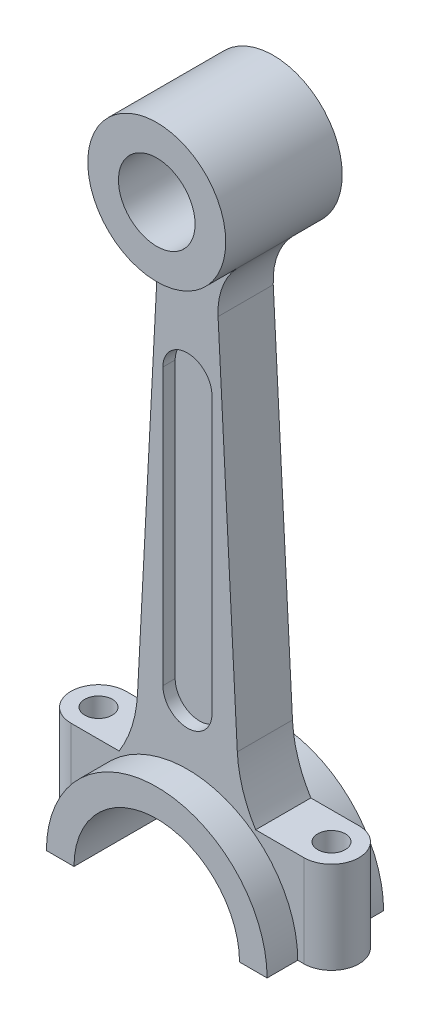
ISO-10303-21;
HEADER;
FILE_DESCRIPTION(('STEP AP214'),'2;1');
FILE_NAME('part.step','',(''),(''),'','','');
FILE_SCHEMA(('AUTOMOTIVE_DESIGN { 1 0 10303 214 1 1 1 1 }'));
ENDSEC;
DATA;
#1=APPLICATION_CONTEXT('core data for automotive mechanical design processes');
#2=APPLICATION_PROTOCOL_DEFINITION('international standard','automotive_design',2000,#1);
#3=PRODUCT_CONTEXT('',#1,'mechanical');
#4=PRODUCT('Part','Part','',(#3));
#5=PRODUCT_RELATED_PRODUCT_CATEGORY('part','',(#4));
#6=PRODUCT_DEFINITION_FORMATION('','',#4);
#7=PRODUCT_DEFINITION_CONTEXT('part definition',#1,'design');
#8=PRODUCT_DEFINITION('design','',#6,#7);
#9=PRODUCT_DEFINITION_SHAPE('','',#8);
#10=(LENGTH_UNIT() NAMED_UNIT(*) SI_UNIT(.MILLI.,.METRE.));
#11=(NAMED_UNIT(*) PLANE_ANGLE_UNIT() SI_UNIT($,.RADIAN.));
#12=(NAMED_UNIT(*) SI_UNIT($,.STERADIAN.) SOLID_ANGLE_UNIT());
#13=UNCERTAINTY_MEASURE_WITH_UNIT(LENGTH_MEASURE(1.E-05),#10,'distance_accuracy_value','');
#14=(GEOMETRIC_REPRESENTATION_CONTEXT(3) GLOBAL_UNCERTAINTY_ASSIGNED_CONTEXT((#13)) GLOBAL_UNIT_ASSIGNED_CONTEXT((#10,
#11,#12)) REPRESENTATION_CONTEXT('',''));
#15=CARTESIAN_POINT('',(0.,0.,0.));
#16=DIRECTION('',(0.,0.,1.));
#17=DIRECTION('',(1.,0.,0.));
#18=AXIS2_PLACEMENT_3D('',#15,#16,#17);
#19=CARTESIAN_POINT('',(0.,0.,8.9999999999999));
#20=DIRECTION('',(0.,0.,1.));
#21=DIRECTION('',(1.,0.,0.));
#22=AXIS2_PLACEMENT_3D('',#19,#20,#21);
#23=PLANE('',#22);
#24=CARTESIAN_POINT('',(0.,-145.6,8.9999999999999));
#25=DIRECTION('',(0.,0.,1.));
#26=DIRECTION('',(1.,0.,0.));
#27=AXIS2_PLACEMENT_3D('',#24,#25,#26);
#28=CIRCLE('',#27,8.00000000000002);
#29=CARTESIAN_POINT('',(-8.00000000000002,-145.6,8.9999999999999));
#30=VERTEX_POINT('',#29);
#31=CARTESIAN_POINT('',(8.00000000000004,-145.6,8.9999999999999));
#32=VERTEX_POINT('',#31);
#33=EDGE_CURVE('E305',#30,#32,#28,.T.);
#34=ORIENTED_EDGE('',*,*,#33,.F.);
#35=DIRECTION('',(0.,-1.,0.));
#36=VECTOR('',#35,1.);
#37=CARTESIAN_POINT('',(-8.00000000000002,-145.6,8.9999999999999));
#38=LINE('',#37,#36);
#39=CARTESIAN_POINT('',(-8.00000000000003,-55.6,8.9999999999999));
#40=VERTEX_POINT('',#39);
#41=EDGE_CURVE('E320',#40,#30,#38,.T.);
#42=ORIENTED_EDGE('',*,*,#41,.F.);
#43=CARTESIAN_POINT('',(0.,-55.6,8.9999999999999));
#44=DIRECTION('',(0.,0.,1.));
#45=DIRECTION('',(1.,0.,0.));
#46=AXIS2_PLACEMENT_3D('',#43,#44,#45);
#47=CIRCLE('',#46,8.00000000000002);
#48=CARTESIAN_POINT('',(8.00000000000001,-55.6,8.9999999999999));
#49=VERTEX_POINT('',#48);
#50=EDGE_CURVE('E339',#49,#40,#47,.T.);
#51=ORIENTED_EDGE('',*,*,#50,.F.);
#52=DIRECTION('',(0.,1.,0.));
#53=VECTOR('',#52,1.);
#54=CARTESIAN_POINT('',(8.00000000000004,-145.6,8.9999999999999));
#55=LINE('',#54,#53);
#56=EDGE_CURVE('E335',#32,#49,#55,.T.);
#57=ORIENTED_EDGE('',*,*,#56,.F.);
#58=EDGE_LOOP('',(#34,#42,#51,#57));
#59=FACE_BOUND('',#58,.T.);
#60=DIRECTION('',(1.,0.,0.));
#61=VECTOR('',#60,1.);
#62=CARTESIAN_POINT('',(47.,-201.2,8.9999999999999));
#63=LINE('',#62,#61);
#64=CARTESIAN_POINT('',(36.,-201.2,8.9999999999999));
#65=VERTEX_POINT('',#64);
#66=CARTESIAN_POINT('',(38.,-201.2,8.9999999999999));
#67=VERTEX_POINT('',#66);
#68=EDGE_CURVE('E230',#65,#67,#63,.T.);
#69=ORIENTED_EDGE('',*,*,#68,.T.);
#70=DIRECTION('',(0.,-1.,0.));
#71=VECTOR('',#70,1.);
#72=CARTESIAN_POINT('',(38.,22.5,8.9999999999999));
#73=LINE('',#72,#71);
#74=CARTESIAN_POINT('',(38.,-171.2,8.9999999999999));
#75=VERTEX_POINT('',#74);
#76=EDGE_CURVE('E236',#75,#67,#73,.T.);
#77=ORIENTED_EDGE('',*,*,#76,.F.);
#78=DIRECTION('',(-1.,0.,0.));
#79=VECTOR('',#78,1.);
#80=CARTESIAN_POINT('',(-47.,-171.2,8.9999999999999));
#81=LINE('',#80,#79);
#82=CARTESIAN_POINT('',(22.264288887721,-171.2,8.9999999999999));
#83=VERTEX_POINT('',#82);
#84=EDGE_CURVE('E248',#75,#83,#81,.T.);
#85=ORIENTED_EDGE('',*,*,#84,.T.);
#86=CARTESIAN_POINT('',(56.2249036129652,-150.065273896179,8.9999999999999));
#87=DIRECTION('',(0.,0.,-1.));
#88=DIRECTION('',(-1.,0.,0.));
#89=AXIS2_PLACEMENT_3D('',#86,#87,#88);
#90=CIRCLE('',#89,40.);
#91=CARTESIAN_POINT('',(16.2797222227823,-152.158712145897,8.9999999999999));
#92=VERTEX_POINT('',#91);
#93=EDGE_CURVE('E403',#83,#92,#90,.T.);
#94=ORIENTED_EDGE('',*,*,#93,.T.);
#95=DIRECTION('',(-0.0523359562429447,0.998629534754574,0.));
#96=VECTOR('',#95,1.);
#97=CARTESIAN_POINT('',(16.2797222227823,-152.158712145897,8.9999999999999));
#98=LINE('',#97,#96);
#99=CARTESIAN_POINT('',(10.,-32.3344740520251,8.9999999999999));
#100=VERTEX_POINT('',#99);
#101=EDGE_CURVE('E406',#92,#100,#98,.T.);
#102=ORIENTED_EDGE('',*,*,#101,.T.);
#103=CARTESIAN_POINT('',(32.4691645319779,-31.1569150365588,8.9999999999999));
#104=DIRECTION('',(0.,0.,-1.));
#105=DIRECTION('',(1.,0.,0.));
#106=AXIS2_PLACEMENT_3D('',#103,#104,#105);
#107=CIRCLE('',#106,22.5);
#108=CARTESIAN_POINT('',(16.234582265989,-15.5784575182794,8.9999999999999));
#109=VERTEX_POINT('',#108);
#110=EDGE_CURVE('E409',#100,#109,#107,.T.);
#111=ORIENTED_EDGE('',*,*,#110,.T.);
#112=CARTESIAN_POINT('',(0.,0.,8.9999999999999));
#113=DIRECTION('',(0.,0.,-1.));
#114=DIRECTION('',(1.,0.,0.));
#115=AXIS2_PLACEMENT_3D('',#112,#113,#114);
#116=CIRCLE('',#115,22.5);
#117=CARTESIAN_POINT('',(-16.2345822659889,-15.5784575182794,8.9999999999999));
#118=VERTEX_POINT('',#117);
#119=EDGE_CURVE('E386',#109,#118,#116,.T.);
#120=ORIENTED_EDGE('',*,*,#119,.T.);
#121=CARTESIAN_POINT('',(-32.4691645319779,-31.1569150365588,8.9999999999999));
#122=DIRECTION('',(0.,0.,-1.));
#123=DIRECTION('',(-1.,0.,0.));
#124=AXIS2_PLACEMENT_3D('',#121,#122,#123);
#125=CIRCLE('',#124,22.5);
#126=CARTESIAN_POINT('',(-10.,-32.3344740520251,8.9999999999999));
#127=VERTEX_POINT('',#126);
#128=EDGE_CURVE('E390',#118,#127,#125,.T.);
#129=ORIENTED_EDGE('',*,*,#128,.T.);
#130=DIRECTION('',(-0.0523359562429445,-0.998629534754574,0.));
#131=VECTOR('',#130,1.);
#132=CARTESIAN_POINT('',(-16.2797222227823,-152.158712145897,8.9999999999999));
#133=LINE('',#132,#131);
#134=CARTESIAN_POINT('',(-16.2797222227823,-152.158712145897,8.9999999999999));
#135=VERTEX_POINT('',#134);
#136=EDGE_CURVE('E394',#127,#135,#133,.T.);
#137=ORIENTED_EDGE('',*,*,#136,.T.);
#138=CARTESIAN_POINT('',(-56.2249036129652,-150.065273896179,8.9999999999999));
#139=DIRECTION('',(0.,0.,-1.));
#140=DIRECTION('',(1.,0.,0.));
#141=AXIS2_PLACEMENT_3D('',#138,#139,#140);
#142=CIRCLE('',#141,40.);
#143=CARTESIAN_POINT('',(-22.264288887721,-171.2,8.9999999999999));
#144=VERTEX_POINT('',#143);
#145=EDGE_CURVE('E397',#135,#144,#142,.T.);
#146=ORIENTED_EDGE('',*,*,#145,.T.);
#147=CARTESIAN_POINT('',(-38.,-171.2,8.9999999999999));
#148=VERTEX_POINT('',#147);
#149=EDGE_CURVE('E254',#144,#148,#81,.T.);
#150=ORIENTED_EDGE('',*,*,#149,.T.);
#151=DIRECTION('',(0.,-1.,0.));
#152=VECTOR('',#151,1.);
#153=CARTESIAN_POINT('',(-38.,22.5,8.9999999999999));
#154=LINE('',#153,#152);
#155=CARTESIAN_POINT('',(-38.,-201.2,8.9999999999999));
#156=VERTEX_POINT('',#155);
#157=EDGE_CURVE('E509',#148,#156,#154,.T.);
#158=ORIENTED_EDGE('',*,*,#157,.T.);
#159=CARTESIAN_POINT('',(-36.,-201.2,8.9999999999999));
#160=VERTEX_POINT('',#159);
#161=EDGE_CURVE('E247',#156,#160,#63,.T.);
#162=ORIENTED_EDGE('',*,*,#161,.T.);
#163=CARTESIAN_POINT('',(0.,-201.2,8.9999999999999));
#164=DIRECTION('',(0.,0.,-1.));
#165=DIRECTION('',(1.,0.,0.));
#166=AXIS2_PLACEMENT_3D('',#163,#164,#165);
#167=CIRCLE('',#166,36.);
#168=EDGE_CURVE('E245',#160,#65,#167,.T.);
#169=ORIENTED_EDGE('',*,*,#168,.T.);
#170=EDGE_LOOP('',(#69,#77,#85,#94,#102,#111,#120,#129,#137,#146,#150,#158,#162,#169));
#171=FACE_BOUND('',#170,.T.);
#172=ADVANCED_FACE('F52',(#59,#171),#23,.T.);
#173=CARTESIAN_POINT('',(0.,0.,-8.9999999999999));
#174=DIRECTION('',(0.,0.,1.));
#175=DIRECTION('',(1.,0.,0.));
#176=AXIS2_PLACEMENT_3D('',#173,#174,#175);
#177=PLANE('',#176);
#178=CARTESIAN_POINT('',(0.,-145.6,-8.9999999999999));
#179=DIRECTION('',(0.,0.,1.));
#180=DIRECTION('',(1.,0.,0.));
#181=AXIS2_PLACEMENT_3D('',#178,#179,#180);
#182=CIRCLE('',#181,8.00000000000002);
#183=CARTESIAN_POINT('',(-8.00000000000002,-145.6,-8.9999999999999));
#184=VERTEX_POINT('',#183);
#185=CARTESIAN_POINT('',(8.00000000000004,-145.6,-8.9999999999999));
#186=VERTEX_POINT('',#185);
#187=EDGE_CURVE('E271',#184,#186,#182,.T.);
#188=ORIENTED_EDGE('',*,*,#187,.T.);
#189=DIRECTION('',(0.,1.,0.));
#190=VECTOR('',#189,1.);
#191=CARTESIAN_POINT('',(8.00000000000004,-145.6,-8.9999999999999));
#192=LINE('',#191,#190);
#193=CARTESIAN_POINT('',(8.00000000000001,-55.6,-8.9999999999999));
#194=VERTEX_POINT('',#193);
#195=EDGE_CURVE('E277',#186,#194,#192,.T.);
#196=ORIENTED_EDGE('',*,*,#195,.T.);
#197=CARTESIAN_POINT('',(0.,-55.6,-8.9999999999999));
#198=DIRECTION('',(0.,0.,1.));
#199=DIRECTION('',(1.,0.,0.));
#200=AXIS2_PLACEMENT_3D('',#197,#198,#199);
#201=CIRCLE('',#200,8.00000000000002);
#202=CARTESIAN_POINT('',(-8.00000000000003,-55.6,-8.9999999999999));
#203=VERTEX_POINT('',#202);
#204=EDGE_CURVE('E294',#194,#203,#201,.T.);
#205=ORIENTED_EDGE('',*,*,#204,.T.);
#206=DIRECTION('',(0.,-1.,0.));
#207=VECTOR('',#206,1.);
#208=CARTESIAN_POINT('',(-8.00000000000002,-145.6,-8.9999999999999));
#209=LINE('',#208,#207);
#210=EDGE_CURVE('E290',#203,#184,#209,.T.);
#211=ORIENTED_EDGE('',*,*,#210,.T.);
#212=EDGE_LOOP('',(#188,#196,#205,#211));
#213=FACE_BOUND('',#212,.T.);
#214=DIRECTION('',(0.,-1.,0.));
#215=VECTOR('',#214,1.);
#216=CARTESIAN_POINT('',(38.,22.5,-8.9999999999999));
#217=LINE('',#216,#215);
#218=CARTESIAN_POINT('',(38.,-171.2,-8.9999999999999));
#219=VERTEX_POINT('',#218);
#220=CARTESIAN_POINT('',(38.,-201.2,-8.9999999999999));
#221=VERTEX_POINT('',#220);
#222=EDGE_CURVE('E68',#219,#221,#217,.T.);
#223=ORIENTED_EDGE('',*,*,#222,.T.);
#224=DIRECTION('',(1.,0.,0.));
#225=VECTOR('',#224,1.);
#226=CARTESIAN_POINT('',(47.,-201.2,-8.9999999999999));
#227=LINE('',#226,#225);
#228=CARTESIAN_POINT('',(36.,-201.2,-8.9999999999999));
#229=VERTEX_POINT('',#228);
#230=EDGE_CURVE('E234',#229,#221,#227,.T.);
#231=ORIENTED_EDGE('',*,*,#230,.F.);
#232=CARTESIAN_POINT('',(0.,-201.2,-8.9999999999999));
#233=DIRECTION('',(0.,0.,-1.));
#234=DIRECTION('',(1.,0.,0.));
#235=AXIS2_PLACEMENT_3D('',#232,#233,#234);
#236=CIRCLE('',#235,36.);
#237=CARTESIAN_POINT('',(-36.,-201.2,-8.9999999999999));
#238=VERTEX_POINT('',#237);
#239=EDGE_CURVE('E426',#238,#229,#236,.T.);
#240=ORIENTED_EDGE('',*,*,#239,.F.);
#241=CARTESIAN_POINT('',(-38.,-201.2,-8.9999999999999));
#242=VERTEX_POINT('',#241);
#243=EDGE_CURVE('E262',#242,#238,#227,.T.);
#244=ORIENTED_EDGE('',*,*,#243,.F.);
#245=DIRECTION('',(0.,-1.,0.));
#246=VECTOR('',#245,1.);
#247=CARTESIAN_POINT('',(-38.,22.5,-8.9999999999999));
#248=LINE('',#247,#246);
#249=CARTESIAN_POINT('',(-38.,-171.2,-8.9999999999999));
#250=VERTEX_POINT('',#249);
#251=EDGE_CURVE('E516',#250,#242,#248,.T.);
#252=ORIENTED_EDGE('',*,*,#251,.F.);
#253=DIRECTION('',(-1.,0.,0.));
#254=VECTOR('',#253,1.);
#255=CARTESIAN_POINT('',(-47.,-171.2,-8.9999999999999));
#256=LINE('',#255,#254);
#257=CARTESIAN_POINT('',(-22.264288887721,-171.2,-8.9999999999999));
#258=VERTEX_POINT('',#257);
#259=EDGE_CURVE('E261',#258,#250,#256,.T.);
#260=ORIENTED_EDGE('',*,*,#259,.F.);
#261=CARTESIAN_POINT('',(-56.2249036129652,-150.065273896179,-8.9999999999999));
#262=DIRECTION('',(0.,0.,-1.));
#263=DIRECTION('',(1.,0.,0.));
#264=AXIS2_PLACEMENT_3D('',#261,#262,#263);
#265=CIRCLE('',#264,40.);
#266=CARTESIAN_POINT('',(-16.2797222227823,-152.158712145897,-8.9999999999999));
#267=VERTEX_POINT('',#266);
#268=EDGE_CURVE('E422',#267,#258,#265,.T.);
#269=ORIENTED_EDGE('',*,*,#268,.F.);
#270=DIRECTION('',(-0.0523359562429445,-0.998629534754574,0.));
#271=VECTOR('',#270,1.);
#272=CARTESIAN_POINT('',(-16.2797222227823,-152.158712145897,-8.9999999999999));
#273=LINE('',#272,#271);
#274=CARTESIAN_POINT('',(-10.,-32.3344740520251,-8.9999999999999));
#275=VERTEX_POINT('',#274);
#276=EDGE_CURVE('E419',#275,#267,#273,.T.);
#277=ORIENTED_EDGE('',*,*,#276,.F.);
#278=CARTESIAN_POINT('',(-32.4691645319779,-31.1569150365588,-8.9999999999999));
#279=DIRECTION('',(0.,0.,-1.));
#280=DIRECTION('',(-1.,0.,0.));
#281=AXIS2_PLACEMENT_3D('',#278,#279,#280);
#282=CIRCLE('',#281,22.5);
#283=CARTESIAN_POINT('',(-16.234582265989,-15.5784575182794,-8.9999999999999));
#284=VERTEX_POINT('',#283);
#285=EDGE_CURVE('E416',#284,#275,#282,.T.);
#286=ORIENTED_EDGE('',*,*,#285,.F.);
#287=CARTESIAN_POINT('',(0.,0.,-8.9999999999999));
#288=DIRECTION('',(0.,0.,-1.));
#289=DIRECTION('',(1.,0.,0.));
#290=AXIS2_PLACEMENT_3D('',#287,#288,#289);
#291=CIRCLE('',#290,22.5);
#292=CARTESIAN_POINT('',(16.234582265989,-15.5784575182794,-8.9999999999999));
#293=VERTEX_POINT('',#292);
#294=EDGE_CURVE('E385',#293,#284,#291,.T.);
#295=ORIENTED_EDGE('',*,*,#294,.F.);
#296=CARTESIAN_POINT('',(32.4691645319779,-31.1569150365588,-8.9999999999999));
#297=DIRECTION('',(0.,0.,-1.));
#298=DIRECTION('',(1.,0.,0.));
#299=AXIS2_PLACEMENT_3D('',#296,#297,#298);
#300=CIRCLE('',#299,22.5);
#301=CARTESIAN_POINT('',(10.,-32.3344740520251,-8.9999999999999));
#302=VERTEX_POINT('',#301);
#303=EDGE_CURVE('E391',#302,#293,#300,.T.);
#304=ORIENTED_EDGE('',*,*,#303,.F.);
#305=DIRECTION('',(-0.0523359562429447,0.998629534754574,0.));
#306=VECTOR('',#305,1.);
#307=CARTESIAN_POINT('',(16.2797222227823,-152.158712145897,-8.9999999999999));
#308=LINE('',#307,#306);
#309=CARTESIAN_POINT('',(16.2797222227823,-152.158712145897,-8.9999999999999));
#310=VERTEX_POINT('',#309);
#311=EDGE_CURVE('E432',#310,#302,#308,.T.);
#312=ORIENTED_EDGE('',*,*,#311,.F.);
#313=CARTESIAN_POINT('',(56.2249036129652,-150.065273896179,-8.9999999999999));
#314=DIRECTION('',(0.,0.,-1.));
#315=DIRECTION('',(-1.,0.,0.));
#316=AXIS2_PLACEMENT_3D('',#313,#314,#315);
#317=CIRCLE('',#316,40.);
#318=CARTESIAN_POINT('',(22.264288887721,-171.2,-8.9999999999999));
#319=VERTEX_POINT('',#318);
#320=EDGE_CURVE('E429',#319,#310,#317,.T.);
#321=ORIENTED_EDGE('',*,*,#320,.F.);
#322=EDGE_CURVE('E258',#219,#319,#256,.T.);
#323=ORIENTED_EDGE('',*,*,#322,.F.);
#324=EDGE_LOOP('',(#223,#231,#240,#244,#252,#260,#269,#277,#286,#295,#304,#312,#321,#323));
#325=FACE_BOUND('',#324,.T.);
#326=ADVANCED_FACE('F564',(#213,#325),#177,.F.);
#327=CARTESIAN_POINT('',(-36.,-201.2,18.9999999999999));
#328=DIRECTION('',(0.,1.,0.));
#329=DIRECTION('',(0.,0.,1.));
#330=AXIS2_PLACEMENT_3D('',#327,#328,#329);
#331=PLANE('',#330);
#332=CARTESIAN_POINT('',(-38.,-201.2,0.));
#333=DIRECTION('',(0.,-1.,0.));
#334=DIRECTION('',(0.,0.,-1.));
#335=AXIS2_PLACEMENT_3D('',#332,#333,#334);
#336=CIRCLE('',#335,4.5);
#337=CARTESIAN_POINT('',(-38.,-201.2,-4.5));
#338=VERTEX_POINT('',#337);
#339=EDGE_CURVE('E471',#338,#338,#336,.T.);
#340=ORIENTED_EDGE('',*,*,#339,.F.);
#341=EDGE_LOOP('',(#340));
#342=FACE_BOUND('',#341,.T.);
#343=ORIENTED_EDGE('',*,*,#161,.F.);
#344=CARTESIAN_POINT('',(-38.,-201.2,0.));
#345=DIRECTION('',(0.,-1.,0.));
#346=DIRECTION('',(0.,0.,-1.));
#347=AXIS2_PLACEMENT_3D('',#344,#345,#346);
#348=CIRCLE('',#347,9.);
#349=EDGE_CURVE('E504',#156,#242,#348,.T.);
#350=ORIENTED_EDGE('',*,*,#349,.T.);
#351=ORIENTED_EDGE('',*,*,#243,.T.);
#352=DIRECTION('',(0.,0.,-1.));
#353=VECTOR('',#352,1.);
#354=CARTESIAN_POINT('',(-36.,-201.2,18.9999999999999));
#355=LINE('',#354,#353);
#356=CARTESIAN_POINT('',(-36.,-201.2,-18.9999999999999));
#357=VERTEX_POINT('',#356);
#358=EDGE_CURVE('E380',#238,#357,#355,.T.);
#359=ORIENTED_EDGE('',*,*,#358,.T.);
#360=DIRECTION('',(1.,0.,0.));
#361=VECTOR('',#360,1.);
#362=CARTESIAN_POINT('',(-36.,-201.2,-18.9999999999999));
#363=LINE('',#362,#361);
#364=CARTESIAN_POINT('',(-27.,-201.2,-18.9999999999999));
#365=VERTEX_POINT('',#364);
#366=EDGE_CURVE('E364',#357,#365,#363,.T.);
#367=ORIENTED_EDGE('',*,*,#366,.T.);
#368=DIRECTION('',(0.,0.,1.));
#369=VECTOR('',#368,1.);
#370=CARTESIAN_POINT('',(-27.,-201.2,-18.9999999999999));
#371=LINE('',#370,#369);
#372=CARTESIAN_POINT('',(-27.,-201.2,18.9999999999999));
#373=VERTEX_POINT('',#372);
#374=EDGE_CURVE('E75',#365,#373,#371,.T.);
#375=ORIENTED_EDGE('',*,*,#374,.T.);
#376=DIRECTION('',(1.,0.,0.));
#377=VECTOR('',#376,1.);
#378=CARTESIAN_POINT('',(-36.,-201.2,18.9999999999999));
#379=LINE('',#378,#377);
#380=CARTESIAN_POINT('',(-36.,-201.2,18.9999999999999));
#381=VERTEX_POINT('',#380);
#382=EDGE_CURVE('E365',#381,#373,#379,.T.);
#383=ORIENTED_EDGE('',*,*,#382,.F.);
#384=EDGE_CURVE('E381',#381,#160,#355,.T.);
#385=ORIENTED_EDGE('',*,*,#384,.T.);
#386=EDGE_LOOP('',(#343,#350,#351,#359,#367,#375,#383,#385));
#387=FACE_BOUND('',#386,.T.);
#388=ADVANCED_FACE('F494',(#342,#387),#331,.F.);
#389=CARTESIAN_POINT('',(-47.,-171.2,8.9999999999999));
#390=DIRECTION('',(0.,-1.,0.));
#391=DIRECTION('',(0.,0.,-1.));
#392=AXIS2_PLACEMENT_3D('',#389,#390,#391);
#393=PLANE('',#392);
#394=CARTESIAN_POINT('',(-38.,-171.2,0.));
#395=DIRECTION('',(0.,-1.,0.));
#396=DIRECTION('',(0.,0.,-1.));
#397=AXIS2_PLACEMENT_3D('',#394,#395,#396);
#398=CIRCLE('',#397,4.5);
#399=CARTESIAN_POINT('',(-38.,-171.2,-4.5));
#400=VERTEX_POINT('',#399);
#401=EDGE_CURVE('E467',#400,#400,#398,.T.);
#402=ORIENTED_EDGE('',*,*,#401,.T.);
#403=EDGE_LOOP('',(#402));
#404=FACE_BOUND('',#403,.T.);
#405=CARTESIAN_POINT('',(-38.,-171.2,0.));
#406=DIRECTION('',(0.,-1.,0.));
#407=DIRECTION('',(0.,0.,-1.));
#408=AXIS2_PLACEMENT_3D('',#405,#406,#407);
#409=CIRCLE('',#408,9.);
#410=EDGE_CURVE('E522',#148,#250,#409,.T.);
#411=ORIENTED_EDGE('',*,*,#410,.F.);
#412=ORIENTED_EDGE('',*,*,#149,.F.);
#413=DIRECTION('',(0.,0.,-1.));
#414=VECTOR('',#413,1.);
#415=CARTESIAN_POINT('',(-22.264288887721,-171.2,8.9999999999999));
#416=LINE('',#415,#414);
#417=EDGE_CURVE('E268',#144,#258,#416,.T.);
#418=ORIENTED_EDGE('',*,*,#417,.T.);
#419=ORIENTED_EDGE('',*,*,#259,.T.);
#420=EDGE_LOOP('',(#411,#412,#418,#419));
#421=FACE_BOUND('',#420,.T.);
#422=ADVANCED_FACE('F592',(#404,#421),#393,.F.);
#423=CARTESIAN_POINT('',(-56.2249036129652,-150.065273896179,8.9999999999999));
#424=DIRECTION('',(0.,0.,-1.));
#425=DIRECTION('',(-1.,0.,0.));
#426=AXIS2_PLACEMENT_3D('',#423,#424,#425);
#427=CYLINDRICAL_SURFACE('',#426,40.);
#428=ORIENTED_EDGE('',*,*,#417,.F.);
#429=ORIENTED_EDGE('',*,*,#145,.F.);
#430=DIRECTION('',(0.,0.,-1.));
#431=VECTOR('',#430,1.);
#432=CARTESIAN_POINT('',(-16.2797222227823,-152.158712145897,8.9999999999999));
#433=LINE('',#432,#431);
#434=EDGE_CURVE('E448',#135,#267,#433,.T.);
#435=ORIENTED_EDGE('',*,*,#434,.T.);
#436=ORIENTED_EDGE('',*,*,#268,.T.);
#437=EDGE_LOOP('',(#428,#429,#435,#436));
#438=FACE_BOUND('',#437,.T.);
#439=ADVANCED_FACE('F588',(#438),#427,.F.);
#440=CARTESIAN_POINT('',(56.2249036129652,-150.065273896179,8.9999999999999));
#441=DIRECTION('',(0.,0.,-1.));
#442=DIRECTION('',(-1.,0.,0.));
#443=AXIS2_PLACEMENT_3D('',#440,#441,#442);
#444=CYLINDRICAL_SURFACE('',#443,40.);
#445=DIRECTION('',(0.,0.,-1.));
#446=VECTOR('',#445,1.);
#447=CARTESIAN_POINT('',(22.264288887721,-171.2,8.9999999999999));
#448=LINE('',#447,#446);
#449=EDGE_CURVE('E253',#319,#83,#448,.F.);
#450=ORIENTED_EDGE('',*,*,#449,.F.);
#451=ORIENTED_EDGE('',*,*,#320,.T.);
#452=DIRECTION('',(0.,0.,-1.));
#453=VECTOR('',#452,1.);
#454=CARTESIAN_POINT('',(16.2797222227823,-152.158712145897,8.9999999999999));
#455=LINE('',#454,#453);
#456=EDGE_CURVE('E444',#92,#310,#455,.T.);
#457=ORIENTED_EDGE('',*,*,#456,.F.);
#458=ORIENTED_EDGE('',*,*,#93,.F.);
#459=EDGE_LOOP('',(#450,#451,#457,#458));
#460=FACE_BOUND('',#459,.T.);
#461=ADVANCED_FACE('F585',(#460),#444,.F.);
#462=CARTESIAN_POINT('',(0.,-201.2,18.9999999999999));
#463=DIRECTION('',(0.,0.,-1.));
#464=DIRECTION('',(-1.,0.,0.));
#465=AXIS2_PLACEMENT_3D('',#462,#463,#464);
#466=CYLINDRICAL_SURFACE('',#465,36.);
#467=ORIENTED_EDGE('',*,*,#168,.F.);
#468=ORIENTED_EDGE('',*,*,#384,.F.);
#469=CARTESIAN_POINT('',(0.,-201.2,18.9999999999999));
#470=DIRECTION('',(0.,0.,1.));
#471=DIRECTION('',(1.,0.,0.));
#472=AXIS2_PLACEMENT_3D('',#469,#470,#471);
#473=CIRCLE('',#472,36.);
#474=CARTESIAN_POINT('',(36.,-201.2,18.9999999999999));
#475=VERTEX_POINT('',#474);
#476=EDGE_CURVE('E359',#475,#381,#473,.T.);
#477=ORIENTED_EDGE('',*,*,#476,.F.);
#478=DIRECTION('',(0.,0.,-1.));
#479=VECTOR('',#478,1.);
#480=CARTESIAN_POINT('',(36.,-201.2,18.9999999999999));
#481=LINE('',#480,#479);
#482=EDGE_CURVE('E377',#475,#65,#481,.T.);
#483=ORIENTED_EDGE('',*,*,#482,.T.);
#484=EDGE_LOOP('',(#467,#468,#477,#483));
#485=FACE_BOUND('',#484,.T.);
#486=ADVANCED_FACE('F502',(#485),#466,.T.);
#487=CARTESIAN_POINT('',(0.,0.,18.9999999999999));
#488=DIRECTION('',(0.,0.,-1.));
#489=DIRECTION('',(-1.,0.,0.));
#490=AXIS2_PLACEMENT_3D('',#487,#488,#489);
#491=CYLINDRICAL_SURFACE('',#490,22.5);
#492=DIRECTION('',(0.,0.,-1.));
#493=VECTOR('',#492,1.);
#494=CARTESIAN_POINT('',(-16.234582265989,-15.5784575182794,8.9999999999999));
#495=LINE('',#494,#493);
#496=EDGE_CURVE('E456',#118,#284,#495,.T.);
#497=ORIENTED_EDGE('',*,*,#496,.F.);
#498=ORIENTED_EDGE('',*,*,#119,.F.);
#499=DIRECTION('',(0.,0.,-1.));
#500=VECTOR('',#499,1.);
#501=CARTESIAN_POINT('',(16.234582265989,-15.5784575182794,8.9999999999999));
#502=LINE('',#501,#500);
#503=EDGE_CURVE('E413',#109,#293,#502,.T.);
#504=ORIENTED_EDGE('',*,*,#503,.T.);
#505=ORIENTED_EDGE('',*,*,#294,.T.);
#506=EDGE_LOOP('',(#497,#498,#504,#505));
#507=FACE_BOUND('',#506,.T.);
#508=CARTESIAN_POINT('',(0.,0.,18.9999999999999));
#509=DIRECTION('',(0.,0.,1.));
#510=DIRECTION('',(1.,0.,0.));
#511=AXIS2_PLACEMENT_3D('',#508,#509,#510);
#512=CIRCLE('',#511,22.5);
#513=CARTESIAN_POINT('',(22.5,0.,18.9999999999999));
#514=VERTEX_POINT('',#513);
#515=EDGE_CURVE('E61',#514,#514,#512,.T.);
#516=ORIENTED_EDGE('',*,*,#515,.F.);
#517=EDGE_LOOP('',(#516));
#518=FACE_BOUND('',#517,.T.);
#519=CARTESIAN_POINT('',(0.,0.,-18.9999999999999));
#520=DIRECTION('',(0.,0.,1.));
#521=DIRECTION('',(1.,0.,0.));
#522=AXIS2_PLACEMENT_3D('',#519,#520,#521);
#523=CIRCLE('',#522,22.5);
#524=CARTESIAN_POINT('',(22.5,0.,-18.9999999999999));
#525=VERTEX_POINT('',#524);
#526=EDGE_CURVE('E460',#525,#525,#523,.T.);
#527=ORIENTED_EDGE('',*,*,#526,.T.);
#528=EDGE_LOOP('',(#527));
#529=FACE_BOUND('',#528,.T.);
#530=ADVANCED_FACE('F54',(#507,#518,#529),#491,.T.);
#531=CARTESIAN_POINT('',(0.,0.,18.9999999999999));
#532=DIRECTION('',(0.,0.,1.));
#533=DIRECTION('',(1.,0.,0.));
#534=AXIS2_PLACEMENT_3D('',#531,#532,#533);
#535=PLANE('',#534);
#536=CARTESIAN_POINT('',(0.,0.,18.9999999999999));
#537=DIRECTION('',(0.,0.,1.));
#538=DIRECTION('',(1.,0.,0.));
#539=AXIS2_PLACEMENT_3D('',#536,#537,#538);
#540=CIRCLE('',#539,12.5);
#541=CARTESIAN_POINT('',(12.5,0.,18.9999999999999));
#542=VERTEX_POINT('',#541);
#543=EDGE_CURVE('E489',#542,#542,#540,.T.);
#544=ORIENTED_EDGE('',*,*,#543,.F.);
#545=EDGE_LOOP('',(#544));
#546=FACE_BOUND('',#545,.T.);
#547=ORIENTED_EDGE('',*,*,#515,.T.);
#548=EDGE_LOOP('',(#547));
#549=FACE_BOUND('',#548,.T.);
#550=ADVANCED_FACE('F542',(#546,#549),#535,.T.);
#551=CARTESIAN_POINT('',(0.,0.,-18.9999999999999));
#552=DIRECTION('',(0.,0.,1.));
#553=DIRECTION('',(1.,0.,0.));
#554=AXIS2_PLACEMENT_3D('',#551,#552,#553);
#555=PLANE('',#554);
#556=CARTESIAN_POINT('',(0.,0.,-18.9999999999999));
#557=DIRECTION('',(0.,0.,1.));
#558=DIRECTION('',(1.,0.,0.));
#559=AXIS2_PLACEMENT_3D('',#556,#557,#558);
#560=CIRCLE('',#559,12.5);
#561=CARTESIAN_POINT('',(12.5,0.,-18.9999999999999));
#562=VERTEX_POINT('',#561);
#563=EDGE_CURVE('E532',#562,#562,#560,.T.);
#564=ORIENTED_EDGE('',*,*,#563,.T.);
#565=EDGE_LOOP('',(#564));
#566=FACE_BOUND('',#565,.T.);
#567=ORIENTED_EDGE('',*,*,#526,.F.);
#568=EDGE_LOOP('',(#567));
#569=FACE_BOUND('',#568,.T.);
#570=ADVANCED_FACE('F545',(#566,#569),#555,.F.);
#571=CARTESIAN_POINT('',(-32.4691645319779,-31.1569150365588,8.9999999999999));
#572=DIRECTION('',(0.,0.,-1.));
#573=DIRECTION('',(-1.,0.,0.));
#574=AXIS2_PLACEMENT_3D('',#571,#572,#573);
#575=CYLINDRICAL_SURFACE('',#574,22.5);
#576=ORIENTED_EDGE('',*,*,#285,.T.);
#577=DIRECTION('',(0.,0.,-1.));
#578=VECTOR('',#577,1.);
#579=CARTESIAN_POINT('',(-10.,-32.3344740520251,8.9999999999999));
#580=LINE('',#579,#578);
#581=EDGE_CURVE('E452',#127,#275,#580,.T.);
#582=ORIENTED_EDGE('',*,*,#581,.F.);
#583=ORIENTED_EDGE('',*,*,#128,.F.);
#584=ORIENTED_EDGE('',*,*,#496,.T.);
#585=EDGE_LOOP('',(#576,#582,#583,#584));
#586=FACE_BOUND('',#585,.T.);
#587=ADVANCED_FACE('F555',(#586),#575,.F.);
#588=CARTESIAN_POINT('',(-16.2797222227823,-152.158712145897,8.9999999999999));
#589=DIRECTION('',(0.998629534754574,-0.0523359562429445,0.));
#590=DIRECTION('',(0.0523359562429445,0.998629534754574,0.));
#591=AXIS2_PLACEMENT_3D('',#588,#589,#590);
#592=PLANE('',#591);
#593=ORIENTED_EDGE('',*,*,#276,.T.);
#594=ORIENTED_EDGE('',*,*,#434,.F.);
#595=ORIENTED_EDGE('',*,*,#136,.F.);
#596=ORIENTED_EDGE('',*,*,#581,.T.);
#597=EDGE_LOOP('',(#593,#594,#595,#596));
#598=FACE_BOUND('',#597,.T.);
#599=ADVANCED_FACE('F560',(#598),#592,.F.);
#600=CARTESIAN_POINT('',(16.2797222227823,-152.158712145897,8.9999999999999));
#601=DIRECTION('',(-0.998629534754574,-0.0523359562429446,0.));
#602=DIRECTION('',(0.0523359562429447,-0.998629534754574,0.));
#603=AXIS2_PLACEMENT_3D('',#600,#601,#602);
#604=PLANE('',#603);
#605=ORIENTED_EDGE('',*,*,#311,.T.);
#606=DIRECTION('',(0.,0.,-1.));
#607=VECTOR('',#606,1.);
#608=CARTESIAN_POINT('',(10.,-32.3344740520251,8.9999999999999));
#609=LINE('',#608,#607);
#610=EDGE_CURVE('E440',#100,#302,#609,.T.);
#611=ORIENTED_EDGE('',*,*,#610,.F.);
#612=ORIENTED_EDGE('',*,*,#101,.F.);
#613=ORIENTED_EDGE('',*,*,#456,.T.);
#614=EDGE_LOOP('',(#605,#611,#612,#613));
#615=FACE_BOUND('',#614,.T.);
#616=ADVANCED_FACE('F580',(#615),#604,.F.);
#617=CARTESIAN_POINT('',(32.4691645319779,-31.1569150365588,8.9999999999999));
#618=DIRECTION('',(0.,0.,-1.));
#619=DIRECTION('',(-1.,0.,0.));
#620=AXIS2_PLACEMENT_3D('',#617,#618,#619);
#621=CYLINDRICAL_SURFACE('',#620,22.5);
#622=ORIENTED_EDGE('',*,*,#303,.T.);
#623=ORIENTED_EDGE('',*,*,#503,.F.);
#624=ORIENTED_EDGE('',*,*,#110,.F.);
#625=ORIENTED_EDGE('',*,*,#610,.T.);
#626=EDGE_LOOP('',(#622,#623,#624,#625));
#627=FACE_BOUND('',#626,.T.);
#628=ADVANCED_FACE('F577',(#627),#621,.F.);
#629=ORIENTED_EDGE('',*,*,#358,.F.);
#630=ORIENTED_EDGE('',*,*,#239,.T.);
#631=CARTESIAN_POINT('',(36.,-201.2,-18.9999999999999));
#632=VERTEX_POINT('',#631);
#633=EDGE_CURVE('E369',#229,#632,#481,.T.);
#634=ORIENTED_EDGE('',*,*,#633,.T.);
#635=CARTESIAN_POINT('',(0.,-201.2,-18.9999999999999));
#636=DIRECTION('',(0.,0.,1.));
#637=DIRECTION('',(1.,0.,0.));
#638=AXIS2_PLACEMENT_3D('',#635,#636,#637);
#639=CIRCLE('',#638,36.);
#640=EDGE_CURVE('E349',#632,#357,#639,.T.);
#641=ORIENTED_EDGE('',*,*,#640,.T.);
#642=EDGE_LOOP('',(#629,#630,#634,#641));
#643=FACE_BOUND('',#642,.T.);
#644=ADVANCED_FACE('F574',(#643),#466,.T.);
#645=CARTESIAN_POINT('',(38.,-201.2,0.));
#646=DIRECTION('',(0.,-1.,0.));
#647=DIRECTION('',(0.,0.,-1.));
#648=AXIS2_PLACEMENT_3D('',#645,#646,#647);
#649=CIRCLE('',#648,4.5);
#650=CARTESIAN_POINT('',(38.,-201.2,-4.5));
#651=VERTEX_POINT('',#650);
#652=EDGE_CURVE('E525',#651,#651,#649,.T.);
#653=ORIENTED_EDGE('',*,*,#652,.F.);
#654=EDGE_LOOP('',(#653));
#655=FACE_BOUND('',#654,.T.);
#656=CARTESIAN_POINT('',(38.,-201.2,0.));
#657=DIRECTION('',(0.,1.,0.));
#658=DIRECTION('',(0.,0.,-1.));
#659=AXIS2_PLACEMENT_3D('',#656,#657,#658);
#660=CIRCLE('',#659,9.);
#661=EDGE_CURVE('E225',#67,#221,#660,.T.);
#662=ORIENTED_EDGE('',*,*,#661,.F.);
#663=ORIENTED_EDGE('',*,*,#68,.F.);
#664=ORIENTED_EDGE('',*,*,#482,.F.);
#665=CARTESIAN_POINT('',(27.,-201.2,18.9999999999999));
#666=VERTEX_POINT('',#665);
#667=EDGE_CURVE('E363',#666,#475,#379,.T.);
#668=ORIENTED_EDGE('',*,*,#667,.F.);
#669=DIRECTION('',(0.,0.,1.));
#670=VECTOR('',#669,1.);
#671=CARTESIAN_POINT('',(27.,-201.2,-18.9999999999999));
#672=LINE('',#671,#670);
#673=CARTESIAN_POINT('',(27.,-201.2,-18.9999999999999));
#674=VERTEX_POINT('',#673);
#675=EDGE_CURVE('E487',#674,#666,#672,.T.);
#676=ORIENTED_EDGE('',*,*,#675,.F.);
#677=EDGE_CURVE('E373',#674,#632,#363,.T.);
#678=ORIENTED_EDGE('',*,*,#677,.T.);
#679=ORIENTED_EDGE('',*,*,#633,.F.);
#680=ORIENTED_EDGE('',*,*,#230,.T.);
#681=EDGE_LOOP('',(#662,#663,#664,#668,#676,#678,#679,#680));
#682=FACE_BOUND('',#681,.T.);
#683=ADVANCED_FACE('F227',(#655,#682),#331,.F.);
#684=CARTESIAN_POINT('',(0.,-201.2,18.9999999999999));
#685=DIRECTION('',(0.,0.,1.));
#686=DIRECTION('',(1.,0.,0.));
#687=AXIS2_PLACEMENT_3D('',#684,#685,#686);
#688=PLANE('',#687);
#689=CARTESIAN_POINT('',(0.,-201.2,18.9999999999999));
#690=DIRECTION('',(0.,0.,1.));
#691=DIRECTION('',(1.,0.,0.));
#692=AXIS2_PLACEMENT_3D('',#689,#690,#691);
#693=CIRCLE('',#692,27.);
#694=EDGE_CURVE('E474',#666,#373,#693,.T.);
#695=ORIENTED_EDGE('',*,*,#694,.F.);
#696=ORIENTED_EDGE('',*,*,#667,.T.);
#697=ORIENTED_EDGE('',*,*,#476,.T.);
#698=ORIENTED_EDGE('',*,*,#382,.T.);
#699=EDGE_LOOP('',(#695,#696,#697,#698));
#700=FACE_BOUND('',#699,.T.);
#701=ADVANCED_FACE('F497',(#700),#688,.T.);
#702=CARTESIAN_POINT('',(0.,-201.2,-18.9999999999999));
#703=DIRECTION('',(0.,0.,1.));
#704=DIRECTION('',(1.,0.,0.));
#705=AXIS2_PLACEMENT_3D('',#702,#703,#704);
#706=PLANE('',#705);
#707=ORIENTED_EDGE('',*,*,#677,.F.);
#708=CARTESIAN_POINT('',(0.,-201.2,-18.9999999999999));
#709=DIRECTION('',(0.,0.,1.));
#710=DIRECTION('',(1.,0.,0.));
#711=AXIS2_PLACEMENT_3D('',#708,#709,#710);
#712=CIRCLE('',#711,27.);
#713=EDGE_CURVE('E479',#674,#365,#712,.T.);
#714=ORIENTED_EDGE('',*,*,#713,.T.);
#715=ORIENTED_EDGE('',*,*,#366,.F.);
#716=ORIENTED_EDGE('',*,*,#640,.F.);
#717=EDGE_LOOP('',(#707,#714,#715,#716));
#718=FACE_BOUND('',#717,.T.);
#719=ADVANCED_FACE('F802',(#718),#706,.F.);
#720=CARTESIAN_POINT('',(0.,-145.6,4.99999999999989));
#721=DIRECTION('',(0.,0.,1.));
#722=DIRECTION('',(1.,0.,0.));
#723=AXIS2_PLACEMENT_3D('',#720,#721,#722);
#724=CYLINDRICAL_SURFACE('',#723,8.00000000000002);
#725=ORIENTED_EDGE('',*,*,#33,.T.);
#726=DIRECTION('',(0.,0.,1.));
#727=VECTOR('',#726,1.);
#728=CARTESIAN_POINT('',(8.00000000000004,-145.6,4.99999999999989));
#729=LINE('',#728,#727);
#730=CARTESIAN_POINT('',(8.00000000000004,-145.6,4.99999999999989));
#731=VERTEX_POINT('',#730);
#732=EDGE_CURVE('E332',#731,#32,#729,.T.);
#733=ORIENTED_EDGE('',*,*,#732,.F.);
#734=CARTESIAN_POINT('',(0.,-145.6,4.99999999999989));
#735=DIRECTION('',(0.,0.,1.));
#736=DIRECTION('',(1.,0.,0.));
#737=AXIS2_PLACEMENT_3D('',#734,#735,#736);
#738=CIRCLE('',#737,8.00000000000002);
#739=CARTESIAN_POINT('',(-8.00000000000002,-145.6,4.99999999999989));
#740=VERTEX_POINT('',#739);
#741=EDGE_CURVE('E315',#740,#731,#738,.T.);
#742=ORIENTED_EDGE('',*,*,#741,.F.);
#743=DIRECTION('',(0.,0.,1.));
#744=VECTOR('',#743,1.);
#745=CARTESIAN_POINT('',(-8.00000000000002,-145.6,4.99999999999989));
#746=LINE('',#745,#744);
#747=EDGE_CURVE('E346',#740,#30,#746,.T.);
#748=ORIENTED_EDGE('',*,*,#747,.T.);
#749=EDGE_LOOP('',(#725,#733,#742,#748));
#750=FACE_BOUND('',#749,.T.);
#751=ADVANCED_FACE('F792',(#750),#724,.F.);
#752=CARTESIAN_POINT('',(-8.00000000000002,-145.6,4.99999999999989));
#753=DIRECTION('',(-1.,0.,0.));
#754=DIRECTION('',(0.,-1.,0.));
#755=AXIS2_PLACEMENT_3D('',#752,#753,#754);
#756=PLANE('',#755);
#757=ORIENTED_EDGE('',*,*,#41,.T.);
#758=ORIENTED_EDGE('',*,*,#747,.F.);
#759=DIRECTION('',(0.,-1.,0.));
#760=VECTOR('',#759,1.);
#761=CARTESIAN_POINT('',(-8.00000000000002,-145.6,4.99999999999989));
#762=LINE('',#761,#760);
#763=CARTESIAN_POINT('',(-8.00000000000003,-55.6,4.99999999999989));
#764=VERTEX_POINT('',#763);
#765=EDGE_CURVE('E328',#764,#740,#762,.T.);
#766=ORIENTED_EDGE('',*,*,#765,.F.);
#767=DIRECTION('',(0.,0.,1.));
#768=VECTOR('',#767,1.);
#769=CARTESIAN_POINT('',(-8.00000000000003,-55.6,4.99999999999989));
#770=LINE('',#769,#768);
#771=EDGE_CURVE('E350',#764,#40,#770,.T.);
#772=ORIENTED_EDGE('',*,*,#771,.T.);
#773=EDGE_LOOP('',(#757,#758,#766,#772));
#774=FACE_BOUND('',#773,.T.);
#775=ADVANCED_FACE('F782',(#774),#756,.F.);
#776=CARTESIAN_POINT('',(0.,-55.6,4.99999999999989));
#777=DIRECTION('',(0.,0.,1.));
#778=DIRECTION('',(1.,0.,0.));
#779=AXIS2_PLACEMENT_3D('',#776,#777,#778);
#780=CYLINDRICAL_SURFACE('',#779,8.00000000000002);
#781=ORIENTED_EDGE('',*,*,#50,.T.);
#782=ORIENTED_EDGE('',*,*,#771,.F.);
#783=CARTESIAN_POINT('',(0.,-55.6,4.99999999999989));
#784=DIRECTION('',(0.,0.,1.));
#785=DIRECTION('',(1.,0.,0.));
#786=AXIS2_PLACEMENT_3D('',#783,#784,#785);
#787=CIRCLE('',#786,8.00000000000002);
#788=CARTESIAN_POINT('',(8.00000000000001,-55.6,4.99999999999989));
#789=VERTEX_POINT('',#788);
#790=EDGE_CURVE('E324',#789,#764,#787,.T.);
#791=ORIENTED_EDGE('',*,*,#790,.F.);
#792=DIRECTION('',(0.,0.,1.));
#793=VECTOR('',#792,1.);
#794=CARTESIAN_POINT('',(8.00000000000001,-55.6,4.99999999999989));
#795=LINE('',#794,#793);
#796=EDGE_CURVE('E353',#789,#49,#795,.T.);
#797=ORIENTED_EDGE('',*,*,#796,.T.);
#798=EDGE_LOOP('',(#781,#782,#791,#797));
#799=FACE_BOUND('',#798,.T.);
#800=ADVANCED_FACE('F772',(#799),#780,.F.);
#801=CARTESIAN_POINT('',(8.00000000000004,-145.6,4.99999999999989));
#802=DIRECTION('',(1.,0.,0.));
#803=DIRECTION('',(0.,1.,0.));
#804=AXIS2_PLACEMENT_3D('',#801,#802,#803);
#805=PLANE('',#804);
#806=ORIENTED_EDGE('',*,*,#56,.T.);
#807=ORIENTED_EDGE('',*,*,#796,.F.);
#808=DIRECTION('',(0.,1.,0.));
#809=VECTOR('',#808,1.);
#810=CARTESIAN_POINT('',(8.00000000000004,-145.6,4.99999999999989));
#811=LINE('',#810,#809);
#812=EDGE_CURVE('E319',#731,#789,#811,.T.);
#813=ORIENTED_EDGE('',*,*,#812,.F.);
#814=ORIENTED_EDGE('',*,*,#732,.T.);
#815=EDGE_LOOP('',(#806,#807,#813,#814));
#816=FACE_BOUND('',#815,.T.);
#817=ADVANCED_FACE('F762',(#816),#805,.F.);
#818=CARTESIAN_POINT('',(0.,-145.6,4.99999999999989));
#819=DIRECTION('',(0.,0.,1.));
#820=DIRECTION('',(1.,0.,0.));
#821=AXIS2_PLACEMENT_3D('',#818,#819,#820);
#822=PLANE('',#821);
#823=ORIENTED_EDGE('',*,*,#741,.T.);
#824=ORIENTED_EDGE('',*,*,#812,.T.);
#825=ORIENTED_EDGE('',*,*,#790,.T.);
#826=ORIENTED_EDGE('',*,*,#765,.T.);
#827=EDGE_LOOP('',(#823,#824,#825,#826));
#828=FACE_BOUND('',#827,.T.);
#829=ADVANCED_FACE('F752',(#828),#822,.T.);
#830=CARTESIAN_POINT('',(0.,-145.6,-4.99999999999989));
#831=DIRECTION('',(0.,0.,-1.));
#832=DIRECTION('',(-1.,0.,0.));
#833=AXIS2_PLACEMENT_3D('',#830,#831,#832);
#834=CYLINDRICAL_SURFACE('',#833,8.00000000000002);
#835=ORIENTED_EDGE('',*,*,#187,.F.);
#836=DIRECTION('',(0.,0.,-1.));
#837=VECTOR('',#836,1.);
#838=CARTESIAN_POINT('',(-8.00000000000002,-145.6,-4.99999999999989));
#839=LINE('',#838,#837);
#840=CARTESIAN_POINT('',(-8.00000000000002,-145.6,-4.99999999999989));
#841=VERTEX_POINT('',#840);
#842=EDGE_CURVE('E286',#841,#184,#839,.T.);
#843=ORIENTED_EDGE('',*,*,#842,.F.);
#844=CARTESIAN_POINT('',(0.,-145.6,-4.99999999999989));
#845=DIRECTION('',(0.,0.,1.));
#846=DIRECTION('',(1.,0.,0.));
#847=AXIS2_PLACEMENT_3D('',#844,#845,#846);
#848=CIRCLE('',#847,8.00000000000002);
#849=CARTESIAN_POINT('',(8.00000000000004,-145.6,-4.99999999999989));
#850=VERTEX_POINT('',#849);
#851=EDGE_CURVE('E272',#841,#850,#848,.T.);
#852=ORIENTED_EDGE('',*,*,#851,.T.);
#853=DIRECTION('',(0.,0.,-1.));
#854=VECTOR('',#853,1.);
#855=CARTESIAN_POINT('',(8.00000000000004,-145.6,-4.99999999999989));
#856=LINE('',#855,#854);
#857=EDGE_CURVE('E301',#850,#186,#856,.T.);
#858=ORIENTED_EDGE('',*,*,#857,.T.);
#859=EDGE_LOOP('',(#835,#843,#852,#858));
#860=FACE_BOUND('',#859,.T.);
#861=ADVANCED_FACE('F742',(#860),#834,.F.);
#862=CARTESIAN_POINT('',(8.00000000000004,-145.6,-4.99999999999989));
#863=DIRECTION('',(-1.,0.,0.));
#864=DIRECTION('',(0.,-1.,0.));
#865=AXIS2_PLACEMENT_3D('',#862,#863,#864);
#866=PLANE('',#865);
#867=ORIENTED_EDGE('',*,*,#195,.F.);
#868=ORIENTED_EDGE('',*,*,#857,.F.);
#869=DIRECTION('',(0.,1.,0.));
#870=VECTOR('',#869,1.);
#871=CARTESIAN_POINT('',(8.00000000000004,-145.6,-4.99999999999989));
#872=LINE('',#871,#870);
#873=CARTESIAN_POINT('',(8.00000000000001,-55.6,-4.99999999999989));
#874=VERTEX_POINT('',#873);
#875=EDGE_CURVE('E283',#850,#874,#872,.T.);
#876=ORIENTED_EDGE('',*,*,#875,.T.);
#877=DIRECTION('',(0.,0.,-1.));
#878=VECTOR('',#877,1.);
#879=CARTESIAN_POINT('',(8.00000000000001,-55.6,-4.99999999999989));
#880=LINE('',#879,#878);
#881=EDGE_CURVE('E306',#874,#194,#880,.T.);
#882=ORIENTED_EDGE('',*,*,#881,.T.);
#883=EDGE_LOOP('',(#867,#868,#876,#882));
#884=FACE_BOUND('',#883,.T.);
#885=ADVANCED_FACE('F732',(#884),#866,.T.);
#886=CARTESIAN_POINT('',(0.,-55.6,-4.99999999999989));
#887=DIRECTION('',(0.,0.,-1.));
#888=DIRECTION('',(-1.,0.,0.));
#889=AXIS2_PLACEMENT_3D('',#886,#887,#888);
#890=CYLINDRICAL_SURFACE('',#889,8.00000000000002);
#891=ORIENTED_EDGE('',*,*,#204,.F.);
#892=ORIENTED_EDGE('',*,*,#881,.F.);
#893=CARTESIAN_POINT('',(0.,-55.6,-4.99999999999989));
#894=DIRECTION('',(0.,0.,1.));
#895=DIRECTION('',(1.,0.,0.));
#896=AXIS2_PLACEMENT_3D('',#893,#894,#895);
#897=CIRCLE('',#896,8.00000000000002);
#898=CARTESIAN_POINT('',(-8.00000000000003,-55.6,-4.99999999999989));
#899=VERTEX_POINT('',#898);
#900=EDGE_CURVE('E280',#874,#899,#897,.T.);
#901=ORIENTED_EDGE('',*,*,#900,.T.);
#902=DIRECTION('',(0.,0.,-1.));
#903=VECTOR('',#902,1.);
#904=CARTESIAN_POINT('',(-8.00000000000003,-55.6,-4.99999999999989));
#905=LINE('',#904,#903);
#906=EDGE_CURVE('E309',#899,#203,#905,.T.);
#907=ORIENTED_EDGE('',*,*,#906,.T.);
#908=EDGE_LOOP('',(#891,#892,#901,#907));
#909=FACE_BOUND('',#908,.T.);
#910=ADVANCED_FACE('F722',(#909),#890,.F.);
#911=CARTESIAN_POINT('',(-8.00000000000002,-145.6,-4.99999999999989));
#912=DIRECTION('',(1.,0.,0.));
#913=DIRECTION('',(0.,1.,0.));
#914=AXIS2_PLACEMENT_3D('',#911,#912,#913);
#915=PLANE('',#914);
#916=ORIENTED_EDGE('',*,*,#210,.F.);
#917=ORIENTED_EDGE('',*,*,#906,.F.);
#918=DIRECTION('',(0.,-1.,0.));
#919=VECTOR('',#918,1.);
#920=CARTESIAN_POINT('',(-8.00000000000002,-145.6,-4.99999999999989));
#921=LINE('',#920,#919);
#922=EDGE_CURVE('E276',#899,#841,#921,.T.);
#923=ORIENTED_EDGE('',*,*,#922,.T.);
#924=ORIENTED_EDGE('',*,*,#842,.T.);
#925=EDGE_LOOP('',(#916,#917,#923,#924));
#926=FACE_BOUND('',#925,.T.);
#927=ADVANCED_FACE('F645',(#926),#915,.T.);
#928=CARTESIAN_POINT('',(0.,-145.6,-4.99999999999989));
#929=DIRECTION('',(0.,0.,-1.));
#930=DIRECTION('',(1.,0.,0.));
#931=AXIS2_PLACEMENT_3D('',#928,#929,#930);
#932=PLANE('',#931);
#933=ORIENTED_EDGE('',*,*,#851,.F.);
#934=ORIENTED_EDGE('',*,*,#922,.F.);
#935=ORIENTED_EDGE('',*,*,#900,.F.);
#936=ORIENTED_EDGE('',*,*,#875,.F.);
#937=EDGE_LOOP('',(#933,#934,#935,#936));
#938=FACE_BOUND('',#937,.T.);
#939=ADVANCED_FACE('F638',(#938),#932,.T.);
#940=CARTESIAN_POINT('',(38.,-171.2,0.));
#941=DIRECTION('',(0.,-1.,0.));
#942=DIRECTION('',(0.,0.,-1.));
#943=AXIS2_PLACEMENT_3D('',#940,#941,#942);
#944=CIRCLE('',#943,4.5);
#945=CARTESIAN_POINT('',(38.,-171.2,-4.5));
#946=VERTEX_POINT('',#945);
#947=EDGE_CURVE('E470',#946,#946,#944,.T.);
#948=ORIENTED_EDGE('',*,*,#947,.T.);
#949=EDGE_LOOP('',(#948));
#950=FACE_BOUND('',#949,.T.);
#951=ORIENTED_EDGE('',*,*,#84,.F.);
#952=CARTESIAN_POINT('',(38.,-171.2,0.));
#953=DIRECTION('',(0.,-1.,0.));
#954=DIRECTION('',(0.,0.,-1.));
#955=AXIS2_PLACEMENT_3D('',#952,#953,#954);
#956=CIRCLE('',#955,9.);
#957=EDGE_CURVE('E13',#75,#219,#956,.F.);
#958=ORIENTED_EDGE('',*,*,#957,.T.);
#959=ORIENTED_EDGE('',*,*,#322,.T.);
#960=ORIENTED_EDGE('',*,*,#449,.T.);
#961=EDGE_LOOP('',(#951,#958,#959,#960));
#962=FACE_BOUND('',#961,.T.);
#963=ADVANCED_FACE('F635',(#950,#962),#393,.F.);
#964=CARTESIAN_POINT('',(0.,-201.2,-18.9999999999999));
#965=DIRECTION('',(0.,0.,1.));
#966=DIRECTION('',(1.,0.,0.));
#967=AXIS2_PLACEMENT_3D('',#964,#965,#966);
#968=CYLINDRICAL_SURFACE('',#967,27.);
#969=ORIENTED_EDGE('',*,*,#694,.T.);
#970=ORIENTED_EDGE('',*,*,#374,.F.);
#971=ORIENTED_EDGE('',*,*,#713,.F.);
#972=ORIENTED_EDGE('',*,*,#675,.T.);
#973=EDGE_LOOP('',(#969,#970,#971,#972));
#974=FACE_BOUND('',#973,.T.);
#975=ADVANCED_FACE('F637',(#974),#968,.F.);
#976=CARTESIAN_POINT('',(0.,0.,-18.9999999999999));
#977=DIRECTION('',(0.,0.,1.));
#978=DIRECTION('',(1.,0.,0.));
#979=AXIS2_PLACEMENT_3D('',#976,#977,#978);
#980=CYLINDRICAL_SURFACE('',#979,12.5);
#981=ORIENTED_EDGE('',*,*,#563,.F.);
#982=EDGE_LOOP('',(#981));
#983=FACE_BOUND('',#982,.T.);
#984=ORIENTED_EDGE('',*,*,#543,.T.);
#985=EDGE_LOOP('',(#984));
#986=FACE_BOUND('',#985,.T.);
#987=ADVANCED_FACE('F540',(#983,#986),#980,.F.);
#988=CARTESIAN_POINT('',(-38.,22.5,0.));
#989=DIRECTION('',(0.,-1.,0.));
#990=DIRECTION('',(0.,0.,-1.));
#991=AXIS2_PLACEMENT_3D('',#988,#989,#990);
#992=CYLINDRICAL_SURFACE('',#991,4.5);
#993=ORIENTED_EDGE('',*,*,#339,.T.);
#994=EDGE_LOOP('',(#993));
#995=FACE_BOUND('',#994,.T.);
#996=ORIENTED_EDGE('',*,*,#401,.F.);
#997=EDGE_LOOP('',(#996));
#998=FACE_BOUND('',#997,.T.);
#999=ADVANCED_FACE('F656',(#995,#998),#992,.F.);
#1000=CARTESIAN_POINT('',(38.,22.5,0.));
#1001=DIRECTION('',(0.,-1.,0.));
#1002=DIRECTION('',(0.,0.,-1.));
#1003=AXIS2_PLACEMENT_3D('',#1000,#1001,#1002);
#1004=CYLINDRICAL_SURFACE('',#1003,4.5);
#1005=ORIENTED_EDGE('',*,*,#652,.T.);
#1006=EDGE_LOOP('',(#1005));
#1007=FACE_BOUND('',#1006,.T.);
#1008=ORIENTED_EDGE('',*,*,#947,.F.);
#1009=EDGE_LOOP('',(#1008));
#1010=FACE_BOUND('',#1009,.T.);
#1011=ADVANCED_FACE('F658',(#1007,#1010),#1004,.F.);
#1012=CARTESIAN_POINT('',(-38.,22.5,0.));
#1013=DIRECTION('',(0.,-1.,0.));
#1014=DIRECTION('',(0.,0.,-1.));
#1015=AXIS2_PLACEMENT_3D('',#1012,#1013,#1014);
#1016=CYLINDRICAL_SURFACE('',#1015,9.);
#1017=ORIENTED_EDGE('',*,*,#410,.T.);
#1018=ORIENTED_EDGE('',*,*,#251,.T.);
#1019=ORIENTED_EDGE('',*,*,#349,.F.);
#1020=ORIENTED_EDGE('',*,*,#157,.F.);
#1021=EDGE_LOOP('',(#1017,#1018,#1019,#1020));
#1022=FACE_BOUND('',#1021,.T.);
#1023=ADVANCED_FACE('F665',(#1022),#1016,.T.);
#1024=CARTESIAN_POINT('',(38.,22.5,0.));
#1025=DIRECTION('',(0.,-1.,0.));
#1026=DIRECTION('',(0.,0.,-1.));
#1027=AXIS2_PLACEMENT_3D('',#1024,#1025,#1026);
#1028=CYLINDRICAL_SURFACE('',#1027,9.);
#1029=ORIENTED_EDGE('',*,*,#957,.F.);
#1030=ORIENTED_EDGE('',*,*,#76,.T.);
#1031=ORIENTED_EDGE('',*,*,#661,.T.);
#1032=ORIENTED_EDGE('',*,*,#222,.F.);
#1033=EDGE_LOOP('',(#1029,#1030,#1031,#1032));
#1034=FACE_BOUND('',#1033,.T.);
#1035=ADVANCED_FACE('F239',(#1034),#1028,.T.);
#1036=CLOSED_SHELL('',(#172,#326,#388,#422,#439,#461,#486,#530,#550,#570,#587,#599,#616,#628,
#644,#683,#701,#719,#751,#775,#800,#817,#829,#861,#885,#910,#927,#939,#963,#975,#987,#999,#1011,
#1023,#1035));
#1037=MANIFOLD_SOLID_BREP('B2',#1036);
#1038=ADVANCED_BREP_SHAPE_REPRESENTATION('',(#18,#1037),#14);
#1039=SHAPE_DEFINITION_REPRESENTATION(#9,#1038);
ENDSEC;
END-ISO-10303-21;
